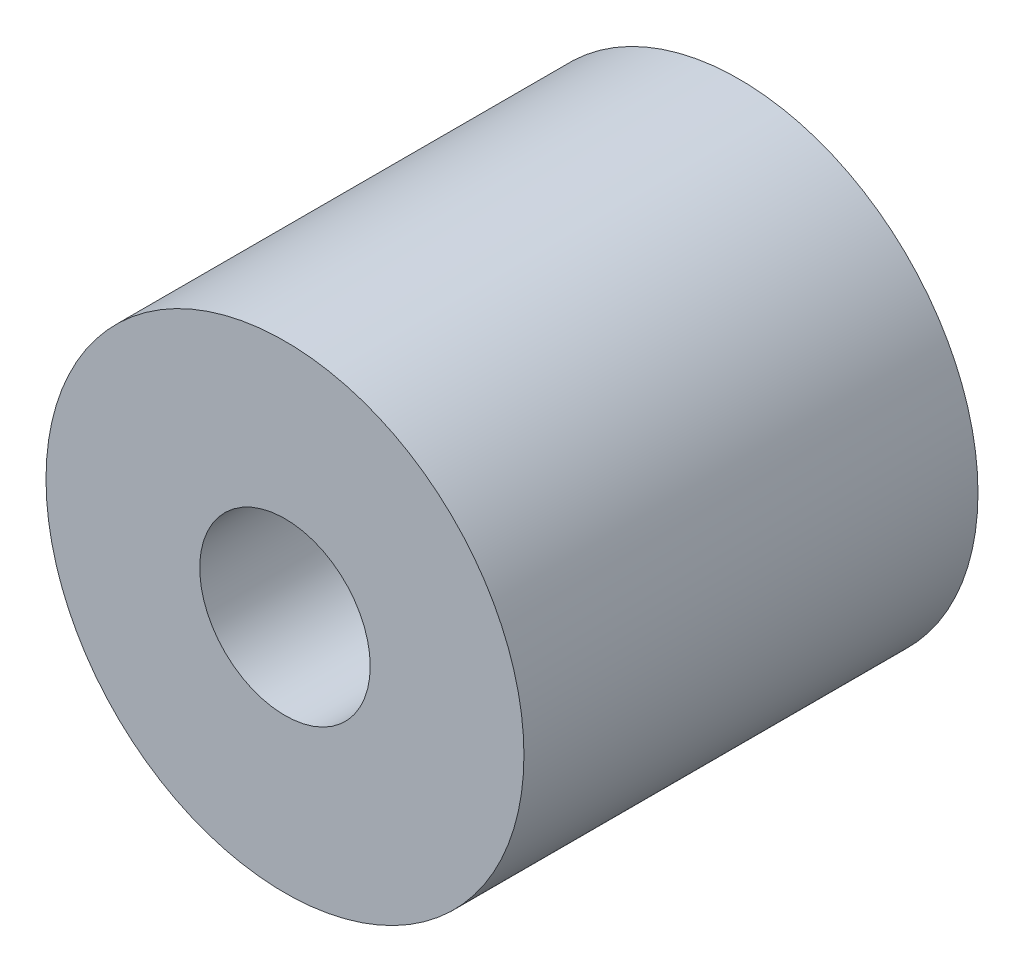
ISO-10303-21;
HEADER;
FILE_DESCRIPTION(('STEP AP214'),'2;1');
FILE_NAME('part.step','',(''),(''),'','','');
FILE_SCHEMA(('AUTOMOTIVE_DESIGN { 1 0 10303 214 1 1 1 1 }'));
ENDSEC;
DATA;
#1=APPLICATION_CONTEXT('core data for automotive mechanical design processes');
#2=APPLICATION_PROTOCOL_DEFINITION('international standard','automotive_design',2000,#1);
#3=PRODUCT_CONTEXT('',#1,'mechanical');
#4=PRODUCT('Part','Part','',(#3));
#5=PRODUCT_RELATED_PRODUCT_CATEGORY('part','',(#4));
#6=PRODUCT_DEFINITION_FORMATION('','',#4);
#7=PRODUCT_DEFINITION_CONTEXT('part definition',#1,'design');
#8=PRODUCT_DEFINITION('design','',#6,#7);
#9=PRODUCT_DEFINITION_SHAPE('','',#8);
#10=(LENGTH_UNIT() NAMED_UNIT(*) SI_UNIT(.MILLI.,.METRE.));
#11=(NAMED_UNIT(*) PLANE_ANGLE_UNIT() SI_UNIT($,.RADIAN.));
#12=(NAMED_UNIT(*) SI_UNIT($,.STERADIAN.) SOLID_ANGLE_UNIT());
#13=UNCERTAINTY_MEASURE_WITH_UNIT(LENGTH_MEASURE(1.E-05),#10,'distance_accuracy_value','');
#14=(GEOMETRIC_REPRESENTATION_CONTEXT(3) GLOBAL_UNCERTAINTY_ASSIGNED_CONTEXT((#13)) GLOBAL_UNIT_ASSIGNED_CONTEXT((#10,
#11,#12)) REPRESENTATION_CONTEXT('',''));
#15=CARTESIAN_POINT('',(0.,0.,0.));
#16=DIRECTION('',(0.,0.,1.));
#17=DIRECTION('',(1.,0.,0.));
#18=AXIS2_PLACEMENT_3D('',#15,#16,#17);
#19=CARTESIAN_POINT('',(0.,0.,0.));
#20=DIRECTION('',(0.,0.,1.));
#21=DIRECTION('',(1.,0.,0.));
#22=AXIS2_PLACEMENT_3D('',#19,#20,#21);
#23=CYLINDRICAL_SURFACE('',#22,2.71857608240417);
#24=CARTESIAN_POINT('',(0.,0.,0.));
#25=DIRECTION('',(0.,0.,1.));
#26=DIRECTION('',(1.,0.,0.));
#27=AXIS2_PLACEMENT_3D('',#24,#25,#26);
#28=CIRCLE('',#27,2.71857608240417);
#29=CARTESIAN_POINT('',(2.71857608240417,0.,0.));
#30=VERTEX_POINT('',#29);
#31=EDGE_CURVE('E27',#30,#30,#28,.T.);
#32=ORIENTED_EDGE('',*,*,#31,.F.);
#33=EDGE_LOOP('',(#32));
#34=FACE_BOUND('',#33,.T.);
#35=CARTESIAN_POINT('',(0.,0.,14.478));
#36=DIRECTION('',(0.,0.,1.));
#37=DIRECTION('',(1.,0.,0.));
#38=AXIS2_PLACEMENT_3D('',#35,#36,#37);
#39=CIRCLE('',#38,2.71857608240417);
#40=CARTESIAN_POINT('',(2.71857608240417,0.,14.478));
#41=VERTEX_POINT('',#40);
#42=EDGE_CURVE('E18',#41,#41,#39,.T.);
#43=ORIENTED_EDGE('',*,*,#42,.T.);
#44=EDGE_LOOP('',(#43));
#45=FACE_BOUND('',#44,.T.);
#46=ADVANCED_FACE('F15',(#34,#45),#23,.F.);
#47=CARTESIAN_POINT('',(0.,0.,14.478));
#48=DIRECTION('',(0.,0.,-1.));
#49=DIRECTION('',(-1.,0.,0.));
#50=AXIS2_PLACEMENT_3D('',#47,#48,#49);
#51=PLANE('',#50);
#52=CARTESIAN_POINT('',(0.,0.,14.478));
#53=DIRECTION('',(0.,0.,1.));
#54=DIRECTION('',(1.,0.,0.));
#55=AXIS2_PLACEMENT_3D('',#52,#53,#54);
#56=CIRCLE('',#55,7.62);
#57=CARTESIAN_POINT('',(7.62,0.,14.478));
#58=VERTEX_POINT('',#57);
#59=EDGE_CURVE('E22',#58,#58,#56,.F.);
#60=ORIENTED_EDGE('',*,*,#59,.F.);
#61=EDGE_LOOP('',(#60));
#62=FACE_BOUND('',#61,.T.);
#63=ORIENTED_EDGE('',*,*,#42,.F.);
#64=EDGE_LOOP('',(#63));
#65=FACE_BOUND('',#64,.T.);
#66=ADVANCED_FACE('F36',(#62,#65),#51,.F.);
#67=CARTESIAN_POINT('',(0.,0.,0.));
#68=DIRECTION('',(0.,0.,-1.));
#69=DIRECTION('',(-1.,0.,0.));
#70=AXIS2_PLACEMENT_3D('',#67,#68,#69);
#71=PLANE('',#70);
#72=CARTESIAN_POINT('',(0.,0.,0.));
#73=DIRECTION('',(0.,0.,1.));
#74=DIRECTION('',(1.,0.,0.));
#75=AXIS2_PLACEMENT_3D('',#72,#73,#74);
#76=CIRCLE('',#75,7.62);
#77=CARTESIAN_POINT('',(7.62,0.,0.));
#78=VERTEX_POINT('',#77);
#79=EDGE_CURVE('E10',#78,#78,#76,.T.);
#80=ORIENTED_EDGE('',*,*,#79,.F.);
#81=EDGE_LOOP('',(#80));
#82=FACE_BOUND('',#81,.T.);
#83=ORIENTED_EDGE('',*,*,#31,.T.);
#84=EDGE_LOOP('',(#83));
#85=FACE_BOUND('',#84,.T.);
#86=ADVANCED_FACE('F38',(#82,#85),#71,.T.);
#87=CARTESIAN_POINT('',(0.,0.,0.));
#88=DIRECTION('',(0.,0.,1.));
#89=DIRECTION('',(1.,0.,0.));
#90=AXIS2_PLACEMENT_3D('',#87,#88,#89);
#91=CYLINDRICAL_SURFACE('',#90,7.62);
#92=ORIENTED_EDGE('',*,*,#79,.T.);
#93=EDGE_LOOP('',(#92));
#94=FACE_BOUND('',#93,.T.);
#95=ORIENTED_EDGE('',*,*,#59,.T.);
#96=EDGE_LOOP('',(#95));
#97=FACE_BOUND('',#96,.T.);
#98=ADVANCED_FACE('F45',(#94,#97),#91,.T.);
#99=CLOSED_SHELL('',(#46,#66,#86,#98));
#100=MANIFOLD_SOLID_BREP('B1',#99);
#101=ADVANCED_BREP_SHAPE_REPRESENTATION('',(#18,#100),#14);
#102=SHAPE_DEFINITION_REPRESENTATION(#9,#101);
ENDSEC;
END-ISO-10303-21;
